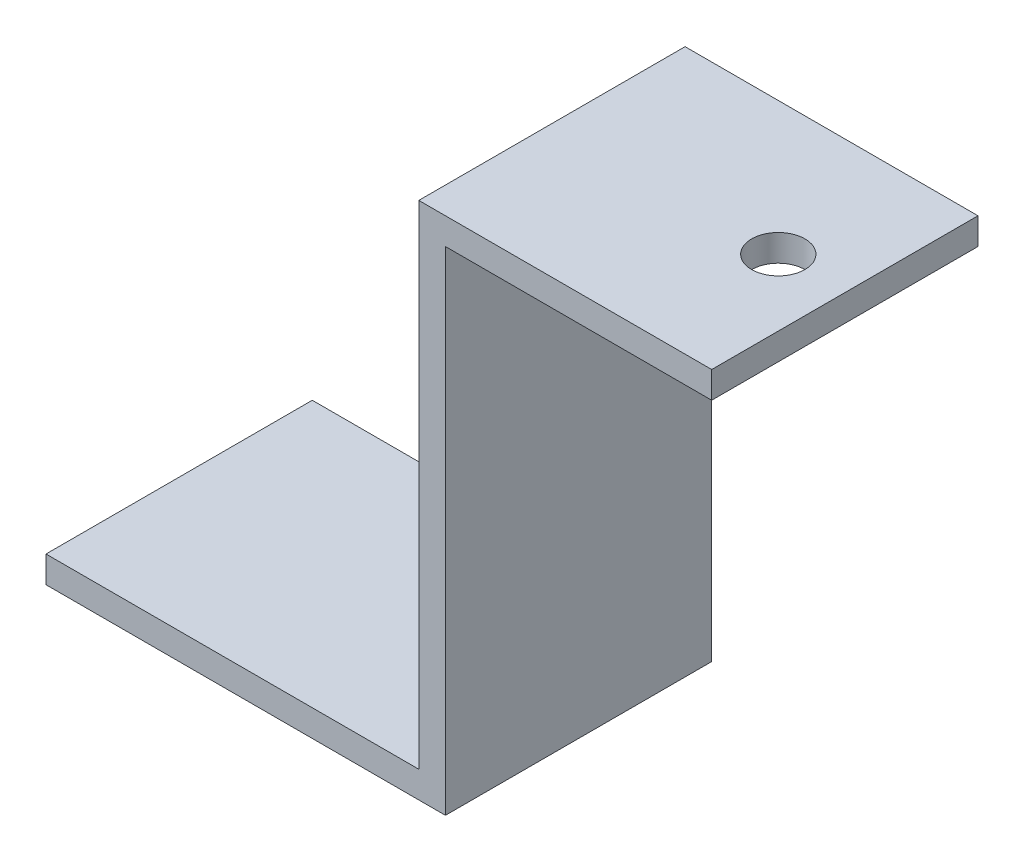
ISO-10303-21;
HEADER;
FILE_DESCRIPTION(('STEP AP214'),'2;1');
FILE_NAME('part.step','',(''),(''),'','','');
FILE_SCHEMA(('AUTOMOTIVE_DESIGN { 1 0 10303 214 1 1 1 1 }'));
ENDSEC;
DATA;
#1=APPLICATION_CONTEXT('core data for automotive mechanical design processes');
#2=APPLICATION_PROTOCOL_DEFINITION('international standard','automotive_design',2000,#1);
#3=PRODUCT_CONTEXT('',#1,'mechanical');
#4=PRODUCT('Part','Part','',(#3));
#5=PRODUCT_RELATED_PRODUCT_CATEGORY('part','',(#4));
#6=PRODUCT_DEFINITION_FORMATION('','',#4);
#7=PRODUCT_DEFINITION_CONTEXT('part definition',#1,'design');
#8=PRODUCT_DEFINITION('design','',#6,#7);
#9=PRODUCT_DEFINITION_SHAPE('','',#8);
#10=(LENGTH_UNIT() NAMED_UNIT(*) SI_UNIT(.MILLI.,.METRE.));
#11=(NAMED_UNIT(*) PLANE_ANGLE_UNIT() SI_UNIT($,.RADIAN.));
#12=(NAMED_UNIT(*) SI_UNIT($,.STERADIAN.) SOLID_ANGLE_UNIT());
#13=UNCERTAINTY_MEASURE_WITH_UNIT(LENGTH_MEASURE(1.E-05),#10,'distance_accuracy_value','');
#14=(GEOMETRIC_REPRESENTATION_CONTEXT(3) GLOBAL_UNCERTAINTY_ASSIGNED_CONTEXT((#13)) GLOBAL_UNIT_ASSIGNED_CONTEXT((#10,
#11,#12)) REPRESENTATION_CONTEXT('',''));
#15=CARTESIAN_POINT('',(0.,0.,0.));
#16=DIRECTION('',(0.,0.,1.));
#17=DIRECTION('',(1.,0.,0.));
#18=AXIS2_PLACEMENT_3D('',#15,#16,#17);
#19=CARTESIAN_POINT('',(-19.1756074084226,-0.639685610563795,20.));
#20=DIRECTION('',(1.,0.,0.));
#21=DIRECTION('',(0.,0.,-1.));
#22=AXIS2_PLACEMENT_3D('',#19,#20,#21);
#23=PLANE('',#22);
#24=DIRECTION('',(0.,-1.,0.));
#25=VECTOR('',#24,1.);
#26=CARTESIAN_POINT('',(-19.1756074084226,-0.639685610563795,0.));
#27=LINE('',#26,#25);
#28=CARTESIAN_POINT('',(-19.1756074084226,36.3603143894362,0.));
#29=VERTEX_POINT('',#28);
#30=CARTESIAN_POINT('',(-19.1756074084226,-0.639685610563795,0.));
#31=VERTEX_POINT('',#30);
#32=EDGE_CURVE('E135',#29,#31,#27,.T.);
#33=ORIENTED_EDGE('',*,*,#32,.T.);
#34=DIRECTION('',(0.,0.,-1.));
#35=VECTOR('',#34,1.);
#36=CARTESIAN_POINT('',(-19.1756074084226,-0.639685610563795,20.));
#37=LINE('',#36,#35);
#38=CARTESIAN_POINT('',(-19.1756074084226,-0.639685610563795,20.));
#39=VERTEX_POINT('',#38);
#40=EDGE_CURVE('E43',#39,#31,#37,.T.);
#41=ORIENTED_EDGE('',*,*,#40,.F.);
#42=DIRECTION('',(0.,-1.,0.));
#43=VECTOR('',#42,1.);
#44=CARTESIAN_POINT('',(-19.1756074084226,-0.639685610563795,20.));
#45=LINE('',#44,#43);
#46=CARTESIAN_POINT('',(-19.1756074084226,36.3603143894362,20.));
#47=VERTEX_POINT('',#46);
#48=EDGE_CURVE('E96',#47,#39,#45,.T.);
#49=ORIENTED_EDGE('',*,*,#48,.F.);
#50=DIRECTION('',(0.,0.,-1.));
#51=VECTOR('',#50,1.);
#52=CARTESIAN_POINT('',(-19.1756074084226,36.3603143894362,20.));
#53=LINE('',#52,#51);
#54=EDGE_CURVE('E11',#47,#29,#53,.T.);
#55=ORIENTED_EDGE('',*,*,#54,.T.);
#56=EDGE_LOOP('',(#33,#41,#49,#55));
#57=FACE_BOUND('',#56,.T.);
#58=ADVANCED_FACE('F35',(#57),#23,.F.);
#59=CARTESIAN_POINT('',(-47.1756074084226,-0.639685610563795,20.));
#60=DIRECTION('',(0.,-1.,0.));
#61=DIRECTION('',(0.,0.,-1.));
#62=AXIS2_PLACEMENT_3D('',#59,#60,#61);
#63=PLANE('',#62);
#64=DIRECTION('',(-1.,0.,0.));
#65=VECTOR('',#64,1.);
#66=CARTESIAN_POINT('',(-47.1756074084226,-0.639685610563795,0.));
#67=LINE('',#66,#65);
#68=CARTESIAN_POINT('',(-47.1756074084226,-0.639685610563795,0.));
#69=VERTEX_POINT('',#68);
#70=EDGE_CURVE('E137',#31,#69,#67,.T.);
#71=ORIENTED_EDGE('',*,*,#70,.T.);
#72=DIRECTION('',(0.,0.,-1.));
#73=VECTOR('',#72,1.);
#74=CARTESIAN_POINT('',(-47.1756074084226,-0.639685610563795,20.));
#75=LINE('',#74,#73);
#76=CARTESIAN_POINT('',(-47.1756074084226,-0.639685610563795,20.));
#77=VERTEX_POINT('',#76);
#78=EDGE_CURVE('E156',#77,#69,#75,.T.);
#79=ORIENTED_EDGE('',*,*,#78,.F.);
#80=DIRECTION('',(-1.,0.,0.));
#81=VECTOR('',#80,1.);
#82=CARTESIAN_POINT('',(-47.1756074084226,-0.639685610563795,20.));
#83=LINE('',#82,#81);
#84=EDGE_CURVE('E164',#39,#77,#83,.T.);
#85=ORIENTED_EDGE('',*,*,#84,.F.);
#86=ORIENTED_EDGE('',*,*,#40,.T.);
#87=EDGE_LOOP('',(#71,#79,#85,#86));
#88=FACE_BOUND('',#87,.T.);
#89=ADVANCED_FACE('F162',(#88),#63,.F.);
#90=CARTESIAN_POINT('',(-47.1756074084226,-2.6396856105638,20.));
#91=DIRECTION('',(1.,0.,0.));
#92=DIRECTION('',(0.,0.,-1.));
#93=AXIS2_PLACEMENT_3D('',#90,#91,#92);
#94=PLANE('',#93);
#95=DIRECTION('',(0.,-1.,0.));
#96=VECTOR('',#95,1.);
#97=CARTESIAN_POINT('',(-47.1756074084226,-2.6396856105638,0.));
#98=LINE('',#97,#96);
#99=CARTESIAN_POINT('',(-47.1756074084226,-2.6396856105638,0.));
#100=VERTEX_POINT('',#99);
#101=EDGE_CURVE('E140',#69,#100,#98,.T.);
#102=ORIENTED_EDGE('',*,*,#101,.T.);
#103=DIRECTION('',(0.,0.,-1.));
#104=VECTOR('',#103,1.);
#105=CARTESIAN_POINT('',(-47.1756074084226,-2.6396856105638,20.));
#106=LINE('',#105,#104);
#107=CARTESIAN_POINT('',(-47.1756074084226,-2.6396856105638,20.));
#108=VERTEX_POINT('',#107);
#109=EDGE_CURVE('E153',#108,#100,#106,.T.);
#110=ORIENTED_EDGE('',*,*,#109,.F.);
#111=DIRECTION('',(0.,-1.,0.));
#112=VECTOR('',#111,1.);
#113=CARTESIAN_POINT('',(-47.1756074084226,-2.6396856105638,20.));
#114=LINE('',#113,#112);
#115=EDGE_CURVE('E174',#77,#108,#114,.T.);
#116=ORIENTED_EDGE('',*,*,#115,.F.);
#117=ORIENTED_EDGE('',*,*,#78,.T.);
#118=EDGE_LOOP('',(#102,#110,#116,#117));
#119=FACE_BOUND('',#118,.T.);
#120=ADVANCED_FACE('F170',(#119),#94,.F.);
#121=CARTESIAN_POINT('',(-17.1756074084226,-2.6396856105638,20.));
#122=DIRECTION('',(0.,1.,0.));
#123=DIRECTION('',(0.,0.,1.));
#124=AXIS2_PLACEMENT_3D('',#121,#122,#123);
#125=PLANE('',#124);
#126=DIRECTION('',(1.,0.,0.));
#127=VECTOR('',#126,1.);
#128=CARTESIAN_POINT('',(-17.1756074084226,-2.6396856105638,0.));
#129=LINE('',#128,#127);
#130=CARTESIAN_POINT('',(-17.1756074084226,-2.6396856105638,0.));
#131=VERTEX_POINT('',#130);
#132=EDGE_CURVE('E142',#100,#131,#129,.T.);
#133=ORIENTED_EDGE('',*,*,#132,.T.);
#134=DIRECTION('',(0.,0.,-1.));
#135=VECTOR('',#134,1.);
#136=CARTESIAN_POINT('',(-17.1756074084226,-2.6396856105638,20.));
#137=LINE('',#136,#135);
#138=CARTESIAN_POINT('',(-17.1756074084226,-2.6396856105638,20.));
#139=VERTEX_POINT('',#138);
#140=EDGE_CURVE('E124',#139,#131,#137,.T.);
#141=ORIENTED_EDGE('',*,*,#140,.F.);
#142=DIRECTION('',(1.,0.,0.));
#143=VECTOR('',#142,1.);
#144=CARTESIAN_POINT('',(-17.1756074084226,-2.6396856105638,20.));
#145=LINE('',#144,#143);
#146=EDGE_CURVE('E116',#108,#139,#145,.T.);
#147=ORIENTED_EDGE('',*,*,#146,.F.);
#148=ORIENTED_EDGE('',*,*,#109,.T.);
#149=EDGE_LOOP('',(#133,#141,#147,#148));
#150=FACE_BOUND('',#149,.T.);
#151=ADVANCED_FACE('F173',(#150),#125,.F.);
#152=CARTESIAN_POINT('',(-17.1756074084226,34.3603143894362,20.));
#153=DIRECTION('',(-1.,0.,0.));
#154=DIRECTION('',(0.,-1.,0.));
#155=AXIS2_PLACEMENT_3D('',#152,#153,#154);
#156=PLANE('',#155);
#157=DIRECTION('',(0.,1.,0.));
#158=VECTOR('',#157,1.);
#159=CARTESIAN_POINT('',(-17.1756074084226,34.3603143894362,0.));
#160=LINE('',#159,#158);
#161=CARTESIAN_POINT('',(-17.1756074084226,34.3603143894362,0.));
#162=VERTEX_POINT('',#161);
#163=EDGE_CURVE('E123',#131,#162,#160,.T.);
#164=ORIENTED_EDGE('',*,*,#163,.T.);
#165=DIRECTION('',(0.,0.,-1.));
#166=VECTOR('',#165,1.);
#167=CARTESIAN_POINT('',(-17.1756074084226,34.3603143894362,20.));
#168=LINE('',#167,#166);
#169=CARTESIAN_POINT('',(-17.1756074084226,34.3603143894362,20.));
#170=VERTEX_POINT('',#169);
#171=EDGE_CURVE('E121',#170,#162,#168,.T.);
#172=ORIENTED_EDGE('',*,*,#171,.F.);
#173=DIRECTION('',(0.,1.,0.));
#174=VECTOR('',#173,1.);
#175=CARTESIAN_POINT('',(-17.1756074084226,-0.639685610563795,20.));
#176=LINE('',#175,#174);
#177=EDGE_CURVE('E110',#139,#170,#176,.T.);
#178=ORIENTED_EDGE('',*,*,#177,.F.);
#179=ORIENTED_EDGE('',*,*,#140,.T.);
#180=EDGE_LOOP('',(#164,#172,#178,#179));
#181=FACE_BOUND('',#180,.T.);
#182=ADVANCED_FACE('F122',(#181),#156,.F.);
#183=CARTESIAN_POINT('',(2.82439259157742,34.3603143894362,20.));
#184=DIRECTION('',(0.,1.,0.));
#185=DIRECTION('',(0.,0.,1.));
#186=AXIS2_PLACEMENT_3D('',#183,#184,#185);
#187=PLANE('',#186);
#188=CARTESIAN_POINT('',(-2.17560740842258,34.3603143894362,10.));
#189=DIRECTION('',(0.,1.,0.));
#190=DIRECTION('',(0.,0.,1.));
#191=AXIS2_PLACEMENT_3D('',#188,#189,#190);
#192=CIRCLE('',#191,2.);
#193=CARTESIAN_POINT('',(-2.17560740842258,34.3603143894362,12.));
#194=VERTEX_POINT('',#193);
#195=EDGE_CURVE('E138',#194,#194,#192,.T.);
#196=ORIENTED_EDGE('',*,*,#195,.T.);
#197=EDGE_LOOP('',(#196));
#198=FACE_BOUND('',#197,.T.);
#199=DIRECTION('',(1.,0.,0.));
#200=VECTOR('',#199,1.);
#201=CARTESIAN_POINT('',(2.82439259157742,34.3603143894362,0.));
#202=LINE('',#201,#200);
#203=CARTESIAN_POINT('',(2.82439259157742,34.3603143894362,0.));
#204=VERTEX_POINT('',#203);
#205=EDGE_CURVE('E81',#162,#204,#202,.T.);
#206=ORIENTED_EDGE('',*,*,#205,.T.);
#207=DIRECTION('',(0.,0.,-1.));
#208=VECTOR('',#207,1.);
#209=CARTESIAN_POINT('',(2.82439259157742,34.3603143894362,20.));
#210=LINE('',#209,#208);
#211=CARTESIAN_POINT('',(2.82439259157742,34.3603143894362,20.));
#212=VERTEX_POINT('',#211);
#213=EDGE_CURVE('E125',#212,#204,#210,.T.);
#214=ORIENTED_EDGE('',*,*,#213,.F.);
#215=DIRECTION('',(1.,0.,0.));
#216=VECTOR('',#215,1.);
#217=CARTESIAN_POINT('',(2.82439259157742,34.3603143894362,20.));
#218=LINE('',#217,#216);
#219=EDGE_CURVE('E114',#170,#212,#218,.T.);
#220=ORIENTED_EDGE('',*,*,#219,.F.);
#221=ORIENTED_EDGE('',*,*,#171,.T.);
#222=EDGE_LOOP('',(#206,#214,#220,#221));
#223=FACE_BOUND('',#222,.T.);
#224=ADVANCED_FACE('F127',(#198,#223),#187,.F.);
#225=CARTESIAN_POINT('',(2.82439259157742,36.3603143894362,20.));
#226=DIRECTION('',(-1.,0.,0.));
#227=DIRECTION('',(0.,-1.,0.));
#228=AXIS2_PLACEMENT_3D('',#225,#226,#227);
#229=PLANE('',#228);
#230=DIRECTION('',(0.,1.,0.));
#231=VECTOR('',#230,1.);
#232=CARTESIAN_POINT('',(2.82439259157742,36.3603143894362,0.));
#233=LINE('',#232,#231);
#234=CARTESIAN_POINT('',(2.82439259157742,36.3603143894362,0.));
#235=VERTEX_POINT('',#234);
#236=EDGE_CURVE('E147',#204,#235,#233,.T.);
#237=ORIENTED_EDGE('',*,*,#236,.T.);
#238=DIRECTION('',(0.,0.,-1.));
#239=VECTOR('',#238,1.);
#240=CARTESIAN_POINT('',(2.82439259157742,36.3603143894362,20.));
#241=LINE('',#240,#239);
#242=CARTESIAN_POINT('',(2.82439259157742,36.3603143894362,20.));
#243=VERTEX_POINT('',#242);
#244=EDGE_CURVE('E131',#243,#235,#241,.T.);
#245=ORIENTED_EDGE('',*,*,#244,.F.);
#246=DIRECTION('',(0.,1.,0.));
#247=VECTOR('',#246,1.);
#248=CARTESIAN_POINT('',(2.82439259157742,36.3603143894362,20.));
#249=LINE('',#248,#247);
#250=EDGE_CURVE('E129',#212,#243,#249,.T.);
#251=ORIENTED_EDGE('',*,*,#250,.F.);
#252=ORIENTED_EDGE('',*,*,#213,.T.);
#253=EDGE_LOOP('',(#237,#245,#251,#252));
#254=FACE_BOUND('',#253,.T.);
#255=ADVANCED_FACE('F191',(#254),#229,.F.);
#256=CARTESIAN_POINT('',(-17.1756074084226,36.3603143894362,20.));
#257=DIRECTION('',(0.,-1.,0.));
#258=DIRECTION('',(0.,0.,-1.));
#259=AXIS2_PLACEMENT_3D('',#256,#257,#258);
#260=PLANE('',#259);
#261=CARTESIAN_POINT('',(-2.17560740842258,36.3603143894362,10.));
#262=DIRECTION('',(0.,1.,0.));
#263=DIRECTION('',(0.,0.,1.));
#264=AXIS2_PLACEMENT_3D('',#261,#262,#263);
#265=CIRCLE('',#264,2.);
#266=CARTESIAN_POINT('',(-2.17560740842258,36.3603143894362,12.));
#267=VERTEX_POINT('',#266);
#268=EDGE_CURVE('E182',#267,#267,#265,.T.);
#269=ORIENTED_EDGE('',*,*,#268,.F.);
#270=EDGE_LOOP('',(#269));
#271=FACE_BOUND('',#270,.T.);
#272=DIRECTION('',(-1.,0.,0.));
#273=VECTOR('',#272,1.);
#274=CARTESIAN_POINT('',(-17.1756074084226,36.3603143894362,0.));
#275=LINE('',#274,#273);
#276=EDGE_CURVE('E88',#235,#29,#275,.T.);
#277=ORIENTED_EDGE('',*,*,#276,.T.);
#278=ORIENTED_EDGE('',*,*,#54,.F.);
#279=DIRECTION('',(-1.,0.,0.));
#280=VECTOR('',#279,1.);
#281=CARTESIAN_POINT('',(-19.1756074084226,36.3603143894362,20.));
#282=LINE('',#281,#280);
#283=EDGE_CURVE('E51',#243,#47,#282,.T.);
#284=ORIENTED_EDGE('',*,*,#283,.F.);
#285=ORIENTED_EDGE('',*,*,#244,.T.);
#286=EDGE_LOOP('',(#277,#278,#284,#285));
#287=FACE_BOUND('',#286,.T.);
#288=ADVANCED_FACE('F189',(#271,#287),#260,.F.);
#289=CARTESIAN_POINT('',(0.,0.,20.));
#290=DIRECTION('',(0.,0.,-1.));
#291=DIRECTION('',(-1.,0.,0.));
#292=AXIS2_PLACEMENT_3D('',#289,#290,#291);
#293=PLANE('',#292);
#294=ORIENTED_EDGE('',*,*,#283,.T.);
#295=ORIENTED_EDGE('',*,*,#48,.T.);
#296=ORIENTED_EDGE('',*,*,#84,.T.);
#297=ORIENTED_EDGE('',*,*,#115,.T.);
#298=ORIENTED_EDGE('',*,*,#146,.T.);
#299=ORIENTED_EDGE('',*,*,#177,.T.);
#300=ORIENTED_EDGE('',*,*,#219,.T.);
#301=ORIENTED_EDGE('',*,*,#250,.T.);
#302=EDGE_LOOP('',(#294,#295,#296,#297,#298,#299,#300,#301));
#303=FACE_BOUND('',#302,.T.);
#304=ADVANCED_FACE('F112',(#303),#293,.F.);
#305=CARTESIAN_POINT('',(0.,0.,0.));
#306=DIRECTION('',(0.,0.,-1.));
#307=DIRECTION('',(-1.,0.,0.));
#308=AXIS2_PLACEMENT_3D('',#305,#306,#307);
#309=PLANE('',#308);
#310=ORIENTED_EDGE('',*,*,#32,.F.);
#311=ORIENTED_EDGE('',*,*,#276,.F.);
#312=ORIENTED_EDGE('',*,*,#236,.F.);
#313=ORIENTED_EDGE('',*,*,#205,.F.);
#314=ORIENTED_EDGE('',*,*,#163,.F.);
#315=ORIENTED_EDGE('',*,*,#132,.F.);
#316=ORIENTED_EDGE('',*,*,#101,.F.);
#317=ORIENTED_EDGE('',*,*,#70,.F.);
#318=EDGE_LOOP('',(#310,#311,#312,#313,#314,#315,#316,#317));
#319=FACE_BOUND('',#318,.T.);
#320=ADVANCED_FACE('F166',(#319),#309,.T.);
#321=CARTESIAN_POINT('',(-2.17560740842258,16.3603143894362,10.));
#322=DIRECTION('',(0.,1.,0.));
#323=DIRECTION('',(0.,0.,1.));
#324=AXIS2_PLACEMENT_3D('',#321,#322,#323);
#325=CYLINDRICAL_SURFACE('',#324,2.);
#326=ORIENTED_EDGE('',*,*,#268,.T.);
#327=EDGE_LOOP('',(#326));
#328=FACE_BOUND('',#327,.T.);
#329=ORIENTED_EDGE('',*,*,#195,.F.);
#330=EDGE_LOOP('',(#329));
#331=FACE_BOUND('',#330,.T.);
#332=ADVANCED_FACE('F186',(#328,#331),#325,.F.);
#333=CLOSED_SHELL('',(#58,#89,#120,#151,#182,#224,#255,#288,#304,#320,#332));
#334=MANIFOLD_SOLID_BREP('B2',#333);
#335=ADVANCED_BREP_SHAPE_REPRESENTATION('',(#18,#334),#14);
#336=SHAPE_DEFINITION_REPRESENTATION(#9,#335);
ENDSEC;
END-ISO-10303-21;
